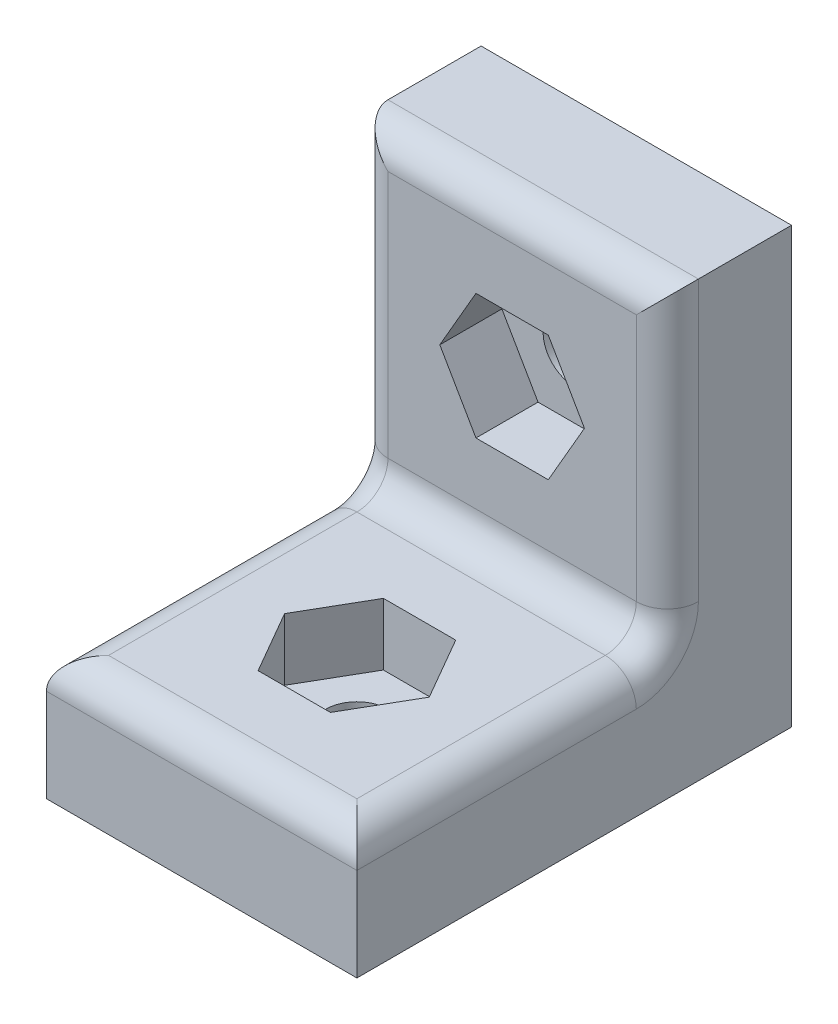
ISO-10303-21;
HEADER;
FILE_DESCRIPTION(('STEP AP214'),'2;1');
FILE_NAME('part.step','',(''),(''),'','','');
FILE_SCHEMA(('AUTOMOTIVE_DESIGN { 1 0 10303 214 1 1 1 1 }'));
ENDSEC;
DATA;
#1=APPLICATION_CONTEXT('core data for automotive mechanical design processes');
#2=APPLICATION_PROTOCOL_DEFINITION('international standard','automotive_design',2000,#1);
#3=PRODUCT_CONTEXT('',#1,'mechanical');
#4=PRODUCT('Part','Part','',(#3));
#5=PRODUCT_RELATED_PRODUCT_CATEGORY('part','',(#4));
#6=PRODUCT_DEFINITION_FORMATION('','',#4);
#7=PRODUCT_DEFINITION_CONTEXT('part definition',#1,'design');
#8=PRODUCT_DEFINITION('design','',#6,#7);
#9=PRODUCT_DEFINITION_SHAPE('','',#8);
#10=(LENGTH_UNIT() NAMED_UNIT(*) SI_UNIT(.MILLI.,.METRE.));
#11=(NAMED_UNIT(*) PLANE_ANGLE_UNIT() SI_UNIT($,.RADIAN.));
#12=(NAMED_UNIT(*) SI_UNIT($,.STERADIAN.) SOLID_ANGLE_UNIT());
#13=UNCERTAINTY_MEASURE_WITH_UNIT(LENGTH_MEASURE(1.E-05),#10,'distance_accuracy_value','');
#14=(GEOMETRIC_REPRESENTATION_CONTEXT(3) GLOBAL_UNCERTAINTY_ASSIGNED_CONTEXT((#13)) GLOBAL_UNIT_ASSIGNED_CONTEXT((#10,
#11,#12)) REPRESENTATION_CONTEXT('',''));
#15=CARTESIAN_POINT('',(0.,0.,0.));
#16=DIRECTION('',(0.,0.,1.));
#17=DIRECTION('',(1.,0.,0.));
#18=AXIS2_PLACEMENT_3D('',#15,#16,#17);
#19=CARTESIAN_POINT('',(0.,0.,9.));
#20=DIRECTION('',(0.,1.,0.));
#21=DIRECTION('',(0.,0.,1.));
#22=AXIS2_PLACEMENT_3D('',#19,#20,#21);
#23=CYLINDRICAL_SURFACE('',#22,1.);
#24=CARTESIAN_POINT('',(0.,0.,9.));
#25=DIRECTION('',(0.,1.,0.));
#26=DIRECTION('',(0.,0.,1.));
#27=AXIS2_PLACEMENT_3D('',#24,#25,#26);
#28=CIRCLE('',#27,1.);
#29=CARTESIAN_POINT('',(0.,0.,10.));
#30=VERTEX_POINT('',#29);
#31=EDGE_CURVE('E298',#30,#30,#28,.T.);
#32=ORIENTED_EDGE('',*,*,#31,.F.);
#33=EDGE_LOOP('',(#32));
#34=FACE_BOUND('',#33,.T.);
#35=CARTESIAN_POINT('',(0.,2.,9.));
#36=DIRECTION('',(0.,1.,0.));
#37=DIRECTION('',(0.,0.,1.));
#38=AXIS2_PLACEMENT_3D('',#35,#36,#37);
#39=CIRCLE('',#38,1.);
#40=CARTESIAN_POINT('',(0.,2.,10.));
#41=VERTEX_POINT('',#40);
#42=EDGE_CURVE('E43',#41,#41,#39,.F.);
#43=ORIENTED_EDGE('',*,*,#42,.F.);
#44=EDGE_LOOP('',(#43));
#45=FACE_BOUND('',#44,.T.);
#46=ADVANCED_FACE('F39',(#34,#45),#23,.F.);
#47=CARTESIAN_POINT('',(0.,9.,0.));
#48=DIRECTION('',(0.,0.,1.));
#49=DIRECTION('',(1.,0.,0.));
#50=AXIS2_PLACEMENT_3D('',#47,#48,#49);
#51=CYLINDRICAL_SURFACE('',#50,1.);
#52=CARTESIAN_POINT('',(0.,9.,0.));
#53=DIRECTION('',(0.,0.,1.));
#54=DIRECTION('',(1.,0.,0.));
#55=AXIS2_PLACEMENT_3D('',#52,#53,#54);
#56=CIRCLE('',#55,1.);
#57=CARTESIAN_POINT('',(1.,9.,0.));
#58=VERTEX_POINT('',#57);
#59=EDGE_CURVE('E302',#58,#58,#56,.T.);
#60=ORIENTED_EDGE('',*,*,#59,.F.);
#61=EDGE_LOOP('',(#60));
#62=FACE_BOUND('',#61,.T.);
#63=CARTESIAN_POINT('',(0.,9.,2.));
#64=DIRECTION('',(0.,0.,1.));
#65=DIRECTION('',(1.,0.,0.));
#66=AXIS2_PLACEMENT_3D('',#63,#64,#65);
#67=CIRCLE('',#66,1.);
#68=CARTESIAN_POINT('',(1.,9.,2.));
#69=VERTEX_POINT('',#68);
#70=EDGE_CURVE('E288',#69,#69,#67,.F.);
#71=ORIENTED_EDGE('',*,*,#70,.F.);
#72=EDGE_LOOP('',(#71));
#73=FACE_BOUND('',#72,.T.);
#74=ADVANCED_FACE('F398',(#62,#73),#51,.F.);
#75=CARTESIAN_POINT('',(-5.,14.,4.));
#76=DIRECTION('',(1.,0.,0.));
#77=DIRECTION('',(0.,1.,0.));
#78=AXIS2_PLACEMENT_3D('',#75,#76,#77);
#79=PLANE('',#78);
#80=CARTESIAN_POINT('',(-5.,5.,5.));
#81=DIRECTION('',(1.,0.,0.));
#82=DIRECTION('',(0.,1.,0.));
#83=AXIS2_PLACEMENT_3D('',#80,#81,#82);
#84=CIRCLE('',#83,2.);
#85=CARTESIAN_POINT('',(-5.,5.,3.));
#86=VERTEX_POINT('',#85);
#87=CARTESIAN_POINT('',(-5.,3.,5.));
#88=VERTEX_POINT('',#87);
#89=EDGE_CURVE('E352',#86,#88,#84,.F.);
#90=ORIENTED_EDGE('',*,*,#89,.F.);
#91=DIRECTION('',(0.,-1.,0.));
#92=VECTOR('',#91,1.);
#93=CARTESIAN_POINT('',(-5.,14.,3.));
#94=LINE('',#93,#92);
#95=CARTESIAN_POINT('',(-5.,14.,3.));
#96=VERTEX_POINT('',#95);
#97=EDGE_CURVE('E357',#86,#96,#94,.F.);
#98=ORIENTED_EDGE('',*,*,#97,.T.);
#99=DIRECTION('',(0.,0.,-1.));
#100=VECTOR('',#99,1.);
#101=CARTESIAN_POINT('',(-5.,14.,4.));
#102=LINE('',#101,#100);
#103=CARTESIAN_POINT('',(-5.,14.,0.));
#104=VERTEX_POINT('',#103);
#105=EDGE_CURVE('E325',#96,#104,#102,.T.);
#106=ORIENTED_EDGE('',*,*,#105,.T.);
#107=DIRECTION('',(0.,-1.,0.));
#108=VECTOR('',#107,1.);
#109=CARTESIAN_POINT('',(-5.,14.,0.));
#110=LINE('',#109,#108);
#111=CARTESIAN_POINT('',(-5.,0.,0.));
#112=VERTEX_POINT('',#111);
#113=EDGE_CURVE('E314',#104,#112,#110,.T.);
#114=ORIENTED_EDGE('',*,*,#113,.T.);
#115=DIRECTION('',(0.,0.,-1.));
#116=VECTOR('',#115,1.);
#117=CARTESIAN_POINT('',(-5.,0.,4.));
#118=LINE('',#117,#116);
#119=CARTESIAN_POINT('',(-5.,0.,14.));
#120=VERTEX_POINT('',#119);
#121=EDGE_CURVE('E332',#120,#112,#118,.T.);
#122=ORIENTED_EDGE('',*,*,#121,.F.);
#123=DIRECTION('',(0.,-1.,0.));
#124=VECTOR('',#123,1.);
#125=CARTESIAN_POINT('',(-5.,0.,14.));
#126=LINE('',#125,#124);
#127=CARTESIAN_POINT('',(-5.,3.,14.));
#128=VERTEX_POINT('',#127);
#129=EDGE_CURVE('E305',#128,#120,#126,.T.);
#130=ORIENTED_EDGE('',*,*,#129,.F.);
#131=DIRECTION('',(0.,0.,-1.));
#132=VECTOR('',#131,1.);
#133=CARTESIAN_POINT('',(-5.,3.,4.));
#134=LINE('',#133,#132);
#135=EDGE_CURVE('E355',#128,#88,#134,.T.);
#136=ORIENTED_EDGE('',*,*,#135,.T.);
#137=EDGE_LOOP('',(#90,#98,#106,#114,#122,#130,#136));
#138=FACE_BOUND('',#137,.T.);
#139=ADVANCED_FACE('F400',(#138),#79,.F.);
#140=CARTESIAN_POINT('',(-5.,0.,4.));
#141=DIRECTION('',(0.,1.,0.));
#142=DIRECTION('',(0.,0.,1.));
#143=AXIS2_PLACEMENT_3D('',#140,#141,#142);
#144=PLANE('',#143);
#145=ORIENTED_EDGE('',*,*,#31,.T.);
#146=EDGE_LOOP('',(#145));
#147=FACE_BOUND('',#146,.T.);
#148=DIRECTION('',(1.,0.,0.));
#149=VECTOR('',#148,1.);
#150=CARTESIAN_POINT('',(-5.,0.,0.));
#151=LINE('',#150,#149);
#152=CARTESIAN_POINT('',(5.,0.,0.));
#153=VERTEX_POINT('',#152);
#154=EDGE_CURVE('E317',#112,#153,#151,.T.);
#155=ORIENTED_EDGE('',*,*,#154,.T.);
#156=DIRECTION('',(0.,0.,-1.));
#157=VECTOR('',#156,1.);
#158=CARTESIAN_POINT('',(5.,0.,4.));
#159=LINE('',#158,#157);
#160=CARTESIAN_POINT('',(5.,0.,14.));
#161=VERTEX_POINT('',#160);
#162=EDGE_CURVE('E329',#161,#153,#159,.T.);
#163=ORIENTED_EDGE('',*,*,#162,.F.);
#164=DIRECTION('',(1.,0.,0.));
#165=VECTOR('',#164,1.);
#166=CARTESIAN_POINT('',(-5.,0.,14.));
#167=LINE('',#166,#165);
#168=EDGE_CURVE('E308',#120,#161,#167,.T.);
#169=ORIENTED_EDGE('',*,*,#168,.F.);
#170=ORIENTED_EDGE('',*,*,#121,.T.);
#171=EDGE_LOOP('',(#155,#163,#169,#170));
#172=FACE_BOUND('',#171,.T.);
#173=ADVANCED_FACE('F407',(#147,#172),#144,.F.);
#174=CARTESIAN_POINT('',(5.,14.,4.));
#175=DIRECTION('',(-1.,0.,0.));
#176=DIRECTION('',(0.,-1.,0.));
#177=AXIS2_PLACEMENT_3D('',#174,#175,#176);
#178=PLANE('',#177);
#179=DIRECTION('',(0.,0.,-1.));
#180=VECTOR('',#179,1.);
#181=CARTESIAN_POINT('',(5.,14.,4.));
#182=LINE('',#181,#180);
#183=CARTESIAN_POINT('',(5.,14.,3.));
#184=VERTEX_POINT('',#183);
#185=CARTESIAN_POINT('',(5.,14.,0.));
#186=VERTEX_POINT('',#185);
#187=EDGE_CURVE('E327',#184,#186,#182,.T.);
#188=ORIENTED_EDGE('',*,*,#187,.F.);
#189=DIRECTION('',(0.,1.,0.));
#190=VECTOR('',#189,1.);
#191=CARTESIAN_POINT('',(5.,4.,3.));
#192=LINE('',#191,#190);
#193=CARTESIAN_POINT('',(5.,5.,3.));
#194=VERTEX_POINT('',#193);
#195=EDGE_CURVE('E349',#184,#194,#192,.F.);
#196=ORIENTED_EDGE('',*,*,#195,.T.);
#197=CARTESIAN_POINT('',(5.,5.,5.));
#198=DIRECTION('',(-1.,0.,0.));
#199=DIRECTION('',(0.,-1.,0.));
#200=AXIS2_PLACEMENT_3D('',#197,#198,#199);
#201=CIRCLE('',#200,2.);
#202=CARTESIAN_POINT('',(5.,3.,5.));
#203=VERTEX_POINT('',#202);
#204=EDGE_CURVE('E346',#203,#194,#201,.F.);
#205=ORIENTED_EDGE('',*,*,#204,.F.);
#206=DIRECTION('',(0.,0.,-1.));
#207=VECTOR('',#206,1.);
#208=CARTESIAN_POINT('',(5.,3.,4.));
#209=LINE('',#208,#207);
#210=CARTESIAN_POINT('',(5.,3.,14.));
#211=VERTEX_POINT('',#210);
#212=EDGE_CURVE('E344',#203,#211,#209,.F.);
#213=ORIENTED_EDGE('',*,*,#212,.T.);
#214=DIRECTION('',(0.,1.,0.));
#215=VECTOR('',#214,1.);
#216=CARTESIAN_POINT('',(5.,0.,14.));
#217=LINE('',#216,#215);
#218=EDGE_CURVE('E311',#161,#211,#217,.T.);
#219=ORIENTED_EDGE('',*,*,#218,.F.);
#220=ORIENTED_EDGE('',*,*,#162,.T.);
#221=DIRECTION('',(0.,1.,0.));
#222=VECTOR('',#221,1.);
#223=CARTESIAN_POINT('',(5.,14.,0.));
#224=LINE('',#223,#222);
#225=EDGE_CURVE('E319',#153,#186,#224,.T.);
#226=ORIENTED_EDGE('',*,*,#225,.T.);
#227=EDGE_LOOP('',(#188,#196,#205,#213,#219,#220,#226));
#228=FACE_BOUND('',#227,.T.);
#229=ADVANCED_FACE('F434',(#228),#178,.F.);
#230=CARTESIAN_POINT('',(-5.,14.,4.));
#231=DIRECTION('',(0.,-1.,0.));
#232=DIRECTION('',(0.,0.,-1.));
#233=AXIS2_PLACEMENT_3D('',#230,#231,#232);
#234=PLANE('',#233);
#235=ORIENTED_EDGE('',*,*,#105,.F.);
#236=DIRECTION('',(-1.,0.,0.));
#237=VECTOR('',#236,1.);
#238=CARTESIAN_POINT('',(5.,14.,3.));
#239=LINE('',#238,#237);
#240=EDGE_CURVE('E359',#96,#184,#239,.F.);
#241=ORIENTED_EDGE('',*,*,#240,.T.);
#242=ORIENTED_EDGE('',*,*,#187,.T.);
#243=DIRECTION('',(-1.,0.,0.));
#244=VECTOR('',#243,1.);
#245=CARTESIAN_POINT('',(-5.,14.,0.));
#246=LINE('',#245,#244);
#247=EDGE_CURVE('E322',#186,#104,#246,.T.);
#248=ORIENTED_EDGE('',*,*,#247,.T.);
#249=EDGE_LOOP('',(#235,#241,#242,#248));
#250=FACE_BOUND('',#249,.T.);
#251=ADVANCED_FACE('F427',(#250),#234,.F.);
#252=CARTESIAN_POINT('',(0.,0.,4.));
#253=DIRECTION('',(0.,0.,1.));
#254=DIRECTION('',(1.,0.,0.));
#255=AXIS2_PLACEMENT_3D('',#252,#253,#254);
#256=PLANE('',#255);
#257=DIRECTION('',(1.,0.,0.));
#258=VECTOR('',#257,1.);
#259=CARTESIAN_POINT('',(-1.165,6.98216080918226,4.));
#260=LINE('',#259,#258);
#261=CARTESIAN_POINT('',(-1.165,6.98216080918226,4.));
#262=VERTEX_POINT('',#261);
#263=CARTESIAN_POINT('',(1.165,6.98216080918226,4.));
#264=VERTEX_POINT('',#263);
#265=EDGE_CURVE('E64',#262,#264,#260,.T.);
#266=ORIENTED_EDGE('',*,*,#265,.F.);
#267=DIRECTION('',(0.5,-0.866025403784439,0.));
#268=VECTOR('',#267,1.);
#269=CARTESIAN_POINT('',(-2.33,9.,4.));
#270=LINE('',#269,#268);
#271=CARTESIAN_POINT('',(-2.33,9.,4.));
#272=VERTEX_POINT('',#271);
#273=EDGE_CURVE('E255',#272,#262,#270,.T.);
#274=ORIENTED_EDGE('',*,*,#273,.F.);
#275=DIRECTION('',(-0.5,-0.866025403784439,0.));
#276=VECTOR('',#275,1.);
#277=CARTESIAN_POINT('',(-1.165,11.0178391908177,4.));
#278=LINE('',#277,#276);
#279=CARTESIAN_POINT('',(-1.165,11.0178391908177,4.));
#280=VERTEX_POINT('',#279);
#281=EDGE_CURVE('E281',#280,#272,#278,.T.);
#282=ORIENTED_EDGE('',*,*,#281,.F.);
#283=DIRECTION('',(-1.,0.,0.));
#284=VECTOR('',#283,1.);
#285=CARTESIAN_POINT('',(1.165,11.0178391908177,4.));
#286=LINE('',#285,#284);
#287=CARTESIAN_POINT('',(1.165,11.0178391908177,4.));
#288=VERTEX_POINT('',#287);
#289=EDGE_CURVE('E278',#288,#280,#286,.T.);
#290=ORIENTED_EDGE('',*,*,#289,.F.);
#291=DIRECTION('',(-0.5,0.866025403784439,0.));
#292=VECTOR('',#291,1.);
#293=CARTESIAN_POINT('',(2.33,9.,4.));
#294=LINE('',#293,#292);
#295=CARTESIAN_POINT('',(2.33,9.,4.));
#296=VERTEX_POINT('',#295);
#297=EDGE_CURVE('E275',#296,#288,#294,.T.);
#298=ORIENTED_EDGE('',*,*,#297,.F.);
#299=DIRECTION('',(0.5,0.866025403784439,0.));
#300=VECTOR('',#299,1.);
#301=CARTESIAN_POINT('',(1.165,6.98216080918226,4.));
#302=LINE('',#301,#300);
#303=EDGE_CURVE('E272',#264,#296,#302,.T.);
#304=ORIENTED_EDGE('',*,*,#303,.F.);
#305=EDGE_LOOP('',(#266,#274,#282,#290,#298,#304));
#306=FACE_BOUND('',#305,.T.);
#307=DIRECTION('',(0.,1.,0.));
#308=VECTOR('',#307,1.);
#309=CARTESIAN_POINT('',(4.,14.,4.));
#310=LINE('',#309,#308);
#311=CARTESIAN_POINT('',(4.,5.,4.));
#312=VERTEX_POINT('',#311);
#313=CARTESIAN_POINT('',(4.,13.,4.));
#314=VERTEX_POINT('',#313);
#315=EDGE_CURVE('E339',#312,#314,#310,.T.);
#316=ORIENTED_EDGE('',*,*,#315,.T.);
#317=DIRECTION('',(-1.,0.,0.));
#318=VECTOR('',#317,1.);
#319=CARTESIAN_POINT('',(-5.,13.,4.));
#320=LINE('',#319,#318);
#321=CARTESIAN_POINT('',(-4.,13.,4.));
#322=VERTEX_POINT('',#321);
#323=EDGE_CURVE('E342',#314,#322,#320,.T.);
#324=ORIENTED_EDGE('',*,*,#323,.T.);
#325=DIRECTION('',(0.,-1.,0.));
#326=VECTOR('',#325,1.);
#327=CARTESIAN_POINT('',(-4.,4.,4.));
#328=LINE('',#327,#326);
#329=CARTESIAN_POINT('',(-4.,5.,4.));
#330=VERTEX_POINT('',#329);
#331=EDGE_CURVE('E337',#322,#330,#328,.T.);
#332=ORIENTED_EDGE('',*,*,#331,.T.);
#333=DIRECTION('',(-1.,0.,0.));
#334=VECTOR('',#333,1.);
#335=CARTESIAN_POINT('',(0.,5.,4.));
#336=LINE('',#335,#334);
#337=EDGE_CURVE('E335',#330,#312,#336,.F.);
#338=ORIENTED_EDGE('',*,*,#337,.T.);
#339=EDGE_LOOP('',(#316,#324,#332,#338));
#340=FACE_BOUND('',#339,.T.);
#341=ADVANCED_FACE('F424',(#306,#340),#256,.T.);
#342=CARTESIAN_POINT('',(0.,0.,0.));
#343=DIRECTION('',(0.,0.,1.));
#344=DIRECTION('',(1.,0.,0.));
#345=AXIS2_PLACEMENT_3D('',#342,#343,#344);
#346=PLANE('',#345);
#347=ORIENTED_EDGE('',*,*,#59,.T.);
#348=EDGE_LOOP('',(#347));
#349=FACE_BOUND('',#348,.T.);
#350=ORIENTED_EDGE('',*,*,#113,.F.);
#351=ORIENTED_EDGE('',*,*,#247,.F.);
#352=ORIENTED_EDGE('',*,*,#225,.F.);
#353=ORIENTED_EDGE('',*,*,#154,.F.);
#354=EDGE_LOOP('',(#350,#351,#352,#353));
#355=FACE_BOUND('',#354,.T.);
#356=ADVANCED_FACE('F422',(#349,#355),#346,.F.);
#357=CARTESIAN_POINT('',(-5.,4.,14.));
#358=DIRECTION('',(0.,-1.,0.));
#359=DIRECTION('',(0.,0.,-1.));
#360=AXIS2_PLACEMENT_3D('',#357,#358,#359);
#361=PLANE('',#360);
#362=DIRECTION('',(-0.5,0.,-0.866025403784439));
#363=VECTOR('',#362,1.);
#364=CARTESIAN_POINT('',(2.33,4.,9.));
#365=LINE('',#364,#363);
#366=CARTESIAN_POINT('',(2.33,4.,9.));
#367=VERTEX_POINT('',#366);
#368=CARTESIAN_POINT('',(1.165,4.,6.98216080918226));
#369=VERTEX_POINT('',#368);
#370=EDGE_CURVE('E232',#367,#369,#365,.T.);
#371=ORIENTED_EDGE('',*,*,#370,.F.);
#372=DIRECTION('',(0.5,0.,-0.866025403784439));
#373=VECTOR('',#372,1.);
#374=CARTESIAN_POINT('',(1.165,4.,11.0178391908177));
#375=LINE('',#374,#373);
#376=CARTESIAN_POINT('',(1.165,4.,11.0178391908177));
#377=VERTEX_POINT('',#376);
#378=EDGE_CURVE('E56',#377,#367,#375,.T.);
#379=ORIENTED_EDGE('',*,*,#378,.F.);
#380=DIRECTION('',(1.,0.,0.));
#381=VECTOR('',#380,1.);
#382=CARTESIAN_POINT('',(-1.165,4.,11.0178391908177));
#383=LINE('',#382,#381);
#384=CARTESIAN_POINT('',(-1.165,4.,11.0178391908177));
#385=VERTEX_POINT('',#384);
#386=EDGE_CURVE('E218',#385,#377,#383,.T.);
#387=ORIENTED_EDGE('',*,*,#386,.F.);
#388=DIRECTION('',(0.5,0.,0.866025403784439));
#389=VECTOR('',#388,1.);
#390=CARTESIAN_POINT('',(-2.33,4.,9.));
#391=LINE('',#390,#389);
#392=CARTESIAN_POINT('',(-2.33,4.,9.));
#393=VERTEX_POINT('',#392);
#394=EDGE_CURVE('E221',#393,#385,#391,.T.);
#395=ORIENTED_EDGE('',*,*,#394,.F.);
#396=DIRECTION('',(-0.5,0.,0.866025403784439));
#397=VECTOR('',#396,1.);
#398=CARTESIAN_POINT('',(-1.165,4.,6.98216080918226));
#399=LINE('',#398,#397);
#400=CARTESIAN_POINT('',(-1.165,4.,6.98216080918226));
#401=VERTEX_POINT('',#400);
#402=EDGE_CURVE('E237',#401,#393,#399,.T.);
#403=ORIENTED_EDGE('',*,*,#402,.F.);
#404=DIRECTION('',(-1.,0.,0.));
#405=VECTOR('',#404,1.);
#406=CARTESIAN_POINT('',(1.165,4.,6.98216080918226));
#407=LINE('',#406,#405);
#408=EDGE_CURVE('E234',#369,#401,#407,.T.);
#409=ORIENTED_EDGE('',*,*,#408,.F.);
#410=EDGE_LOOP('',(#371,#379,#387,#395,#403,#409));
#411=FACE_BOUND('',#410,.T.);
#412=DIRECTION('',(0.,0.,-1.));
#413=VECTOR('',#412,1.);
#414=CARTESIAN_POINT('',(-4.,4.,14.));
#415=LINE('',#414,#413);
#416=CARTESIAN_POINT('',(-4.,4.,5.));
#417=VERTEX_POINT('',#416);
#418=CARTESIAN_POINT('',(-4.,4.,13.));
#419=VERTEX_POINT('',#418);
#420=EDGE_CURVE('E365',#417,#419,#415,.F.);
#421=ORIENTED_EDGE('',*,*,#420,.T.);
#422=DIRECTION('',(-1.,0.,0.));
#423=VECTOR('',#422,1.);
#424=CARTESIAN_POINT('',(-5.,4.,13.));
#425=LINE('',#424,#423);
#426=CARTESIAN_POINT('',(4.,4.,13.));
#427=VERTEX_POINT('',#426);
#428=EDGE_CURVE('E12',#419,#427,#425,.F.);
#429=ORIENTED_EDGE('',*,*,#428,.T.);
#430=DIRECTION('',(0.,0.,-1.));
#431=VECTOR('',#430,1.);
#432=CARTESIAN_POINT('',(4.,4.,14.));
#433=LINE('',#432,#431);
#434=CARTESIAN_POINT('',(4.,4.,5.));
#435=VERTEX_POINT('',#434);
#436=EDGE_CURVE('E48',#427,#435,#433,.T.);
#437=ORIENTED_EDGE('',*,*,#436,.T.);
#438=DIRECTION('',(-1.,0.,0.));
#439=VECTOR('',#438,1.);
#440=CARTESIAN_POINT('',(-5.,4.,5.));
#441=LINE('',#440,#439);
#442=EDGE_CURVE('E363',#435,#417,#441,.T.);
#443=ORIENTED_EDGE('',*,*,#442,.T.);
#444=EDGE_LOOP('',(#421,#429,#437,#443));
#445=FACE_BOUND('',#444,.T.);
#446=ADVANCED_FACE('F418',(#411,#445),#361,.F.);
#447=CARTESIAN_POINT('',(0.,0.,14.));
#448=DIRECTION('',(0.,0.,-1.));
#449=DIRECTION('',(-1.,0.,0.));
#450=AXIS2_PLACEMENT_3D('',#447,#448,#449);
#451=PLANE('',#450);
#452=ORIENTED_EDGE('',*,*,#218,.T.);
#453=DIRECTION('',(-1.,0.,0.));
#454=VECTOR('',#453,1.);
#455=CARTESIAN_POINT('',(0.,3.,14.));
#456=LINE('',#455,#454);
#457=EDGE_CURVE('E361',#211,#128,#456,.T.);
#458=ORIENTED_EDGE('',*,*,#457,.T.);
#459=ORIENTED_EDGE('',*,*,#129,.T.);
#460=ORIENTED_EDGE('',*,*,#168,.T.);
#461=EDGE_LOOP('',(#452,#458,#459,#460));
#462=FACE_BOUND('',#461,.T.);
#463=ADVANCED_FACE('F415',(#462),#451,.F.);
#464=CARTESIAN_POINT('',(-4.,3.,4.));
#465=DIRECTION('',(0.,0.,-1.));
#466=DIRECTION('',(-1.,0.,0.));
#467=AXIS2_PLACEMENT_3D('',#464,#465,#466);
#468=CYLINDRICAL_SURFACE('',#467,1.);
#469=CARTESIAN_POINT('',(-4.,3.,5.));
#470=DIRECTION('',(0.,0.,-1.));
#471=DIRECTION('',(-1.,0.,0.));
#472=AXIS2_PLACEMENT_3D('',#469,#470,#471);
#473=CIRCLE('',#472,1.);
#474=EDGE_CURVE('E389',#88,#417,#473,.T.);
#475=ORIENTED_EDGE('',*,*,#474,.F.);
#476=ORIENTED_EDGE('',*,*,#135,.F.);
#477=CARTESIAN_POINT('',(-4.,3.,13.));
#478=DIRECTION('',(-0.707106781186547,0.,-0.707106781186547));
#479=DIRECTION('',(0.707106781186547,0.,-0.707106781186547));
#480=AXIS2_PLACEMENT_3D('',#477,#478,#479);
#481=ELLIPSE('',#480,1.41421356237309,1.);
#482=EDGE_CURVE('E306',#419,#128,#481,.F.);
#483=ORIENTED_EDGE('',*,*,#482,.F.);
#484=ORIENTED_EDGE('',*,*,#420,.F.);
#485=EDGE_LOOP('',(#475,#476,#483,#484));
#486=FACE_BOUND('',#485,.T.);
#487=ADVANCED_FACE('F41',(#486),#468,.T.);
#488=CARTESIAN_POINT('',(0.,3.,13.));
#489=DIRECTION('',(-1.,0.,0.));
#490=DIRECTION('',(0.,0.,1.));
#491=AXIS2_PLACEMENT_3D('',#488,#489,#490);
#492=CYLINDRICAL_SURFACE('',#491,1.);
#493=ORIENTED_EDGE('',*,*,#482,.T.);
#494=ORIENTED_EDGE('',*,*,#457,.F.);
#495=CARTESIAN_POINT('',(4.,3.,13.));
#496=DIRECTION('',(0.707106781186547,0.,-0.707106781186547));
#497=DIRECTION('',(-0.707106781186547,0.,-0.707106781186547));
#498=AXIS2_PLACEMENT_3D('',#495,#496,#497);
#499=ELLIPSE('',#498,1.41421356237309,1.);
#500=EDGE_CURVE('E386',#427,#211,#499,.T.);
#501=ORIENTED_EDGE('',*,*,#500,.F.);
#502=ORIENTED_EDGE('',*,*,#428,.F.);
#503=EDGE_LOOP('',(#493,#494,#501,#502));
#504=FACE_BOUND('',#503,.T.);
#505=ADVANCED_FACE('F468',(#504),#492,.T.);
#506=CARTESIAN_POINT('',(-4.,5.,5.));
#507=DIRECTION('',(1.,0.,0.));
#508=DIRECTION('',(0.,1.,0.));
#509=AXIS2_PLACEMENT_3D('',#506,#507,#508);
#510=TOROIDAL_SURFACE('',#509,2.,1.);
#511=ORIENTED_EDGE('',*,*,#89,.T.);
#512=ORIENTED_EDGE('',*,*,#474,.T.);
#513=CARTESIAN_POINT('',(-4.,5.,5.));
#514=DIRECTION('',(1.,0.,0.));
#515=DIRECTION('',(0.,1.,0.));
#516=AXIS2_PLACEMENT_3D('',#513,#514,#515);
#517=CIRCLE('',#516,1.);
#518=EDGE_CURVE('E383',#330,#417,#517,.F.);
#519=ORIENTED_EDGE('',*,*,#518,.F.);
#520=CARTESIAN_POINT('',(-4.,5.,3.));
#521=DIRECTION('',(0.,-1.,0.));
#522=DIRECTION('',(0.,0.,-1.));
#523=AXIS2_PLACEMENT_3D('',#520,#521,#522);
#524=CIRCLE('',#523,1.);
#525=EDGE_CURVE('E380',#86,#330,#524,.F.);
#526=ORIENTED_EDGE('',*,*,#525,.F.);
#527=EDGE_LOOP('',(#511,#512,#519,#526));
#528=FACE_BOUND('',#527,.T.);
#529=ADVANCED_FACE('F465',(#528),#510,.T.);
#530=CARTESIAN_POINT('',(4.,3.,14.));
#531=DIRECTION('',(0.,0.,-1.));
#532=DIRECTION('',(-1.,0.,0.));
#533=AXIS2_PLACEMENT_3D('',#530,#531,#532);
#534=CYLINDRICAL_SURFACE('',#533,1.);
#535=ORIENTED_EDGE('',*,*,#500,.T.);
#536=ORIENTED_EDGE('',*,*,#212,.F.);
#537=CARTESIAN_POINT('',(4.,3.,5.));
#538=DIRECTION('',(0.,0.,-1.));
#539=DIRECTION('',(-1.,0.,0.));
#540=AXIS2_PLACEMENT_3D('',#537,#538,#539);
#541=CIRCLE('',#540,1.);
#542=EDGE_CURVE('E377',#435,#203,#541,.T.);
#543=ORIENTED_EDGE('',*,*,#542,.F.);
#544=ORIENTED_EDGE('',*,*,#436,.F.);
#545=EDGE_LOOP('',(#535,#536,#543,#544));
#546=FACE_BOUND('',#545,.T.);
#547=ADVANCED_FACE('F461',(#546),#534,.T.);
#548=CARTESIAN_POINT('',(-5.,5.,5.));
#549=DIRECTION('',(-1.,0.,0.));
#550=DIRECTION('',(0.,0.,1.));
#551=AXIS2_PLACEMENT_3D('',#548,#549,#550);
#552=CYLINDRICAL_SURFACE('',#551,1.);
#553=ORIENTED_EDGE('',*,*,#518,.T.);
#554=ORIENTED_EDGE('',*,*,#442,.F.);
#555=CARTESIAN_POINT('',(4.,5.,5.));
#556=DIRECTION('',(-1.,0.,0.));
#557=DIRECTION('',(0.,-1.,0.));
#558=AXIS2_PLACEMENT_3D('',#555,#556,#557);
#559=CIRCLE('',#558,1.);
#560=EDGE_CURVE('E374',#312,#435,#559,.T.);
#561=ORIENTED_EDGE('',*,*,#560,.F.);
#562=ORIENTED_EDGE('',*,*,#337,.F.);
#563=EDGE_LOOP('',(#553,#554,#561,#562));
#564=FACE_BOUND('',#563,.T.);
#565=ADVANCED_FACE('F457',(#564),#552,.F.);
#566=CARTESIAN_POINT('',(-4.,0.,3.));
#567=DIRECTION('',(0.,1.,0.));
#568=DIRECTION('',(-1.,0.,0.));
#569=AXIS2_PLACEMENT_3D('',#566,#567,#568);
#570=CYLINDRICAL_SURFACE('',#569,1.);
#571=ORIENTED_EDGE('',*,*,#525,.T.);
#572=ORIENTED_EDGE('',*,*,#331,.F.);
#573=CARTESIAN_POINT('',(-4.,13.,3.));
#574=DIRECTION('',(0.707106781186547,0.707106781186548,0.));
#575=DIRECTION('',(0.707106781186548,-0.707106781186547,0.));
#576=AXIS2_PLACEMENT_3D('',#573,#574,#575);
#577=ELLIPSE('',#576,1.4142135623731,1.);
#578=EDGE_CURVE('E371',#96,#322,#577,.T.);
#579=ORIENTED_EDGE('',*,*,#578,.F.);
#580=ORIENTED_EDGE('',*,*,#97,.F.);
#581=EDGE_LOOP('',(#571,#572,#579,#580));
#582=FACE_BOUND('',#581,.T.);
#583=ADVANCED_FACE('F453',(#582),#570,.T.);
#584=CARTESIAN_POINT('',(4.,5.,5.));
#585=DIRECTION('',(-1.,0.,0.));
#586=DIRECTION('',(0.,-1.,0.));
#587=AXIS2_PLACEMENT_3D('',#584,#585,#586);
#588=TOROIDAL_SURFACE('',#587,2.,1.);
#589=ORIENTED_EDGE('',*,*,#542,.T.);
#590=ORIENTED_EDGE('',*,*,#204,.T.);
#591=CARTESIAN_POINT('',(4.,5.,3.));
#592=DIRECTION('',(0.,-1.,0.));
#593=DIRECTION('',(0.,0.,-1.));
#594=AXIS2_PLACEMENT_3D('',#591,#592,#593);
#595=CIRCLE('',#594,1.);
#596=EDGE_CURVE('E369',#312,#194,#595,.F.);
#597=ORIENTED_EDGE('',*,*,#596,.F.);
#598=ORIENTED_EDGE('',*,*,#560,.T.);
#599=EDGE_LOOP('',(#589,#590,#597,#598));
#600=FACE_BOUND('',#599,.T.);
#601=ADVANCED_FACE('F449',(#600),#588,.T.);
#602=CARTESIAN_POINT('',(0.,13.,3.));
#603=DIRECTION('',(1.,0.,0.));
#604=DIRECTION('',(0.,0.,-1.));
#605=AXIS2_PLACEMENT_3D('',#602,#603,#604);
#606=CYLINDRICAL_SURFACE('',#605,1.);
#607=ORIENTED_EDGE('',*,*,#578,.T.);
#608=ORIENTED_EDGE('',*,*,#323,.F.);
#609=CARTESIAN_POINT('',(4.,13.,3.));
#610=DIRECTION('',(0.707106781186548,-0.707106781186547,0.));
#611=DIRECTION('',(0.707106781186547,0.707106781186548,0.));
#612=AXIS2_PLACEMENT_3D('',#609,#610,#611);
#613=ELLIPSE('',#612,1.41421356237309,1.);
#614=EDGE_CURVE('E301',#184,#314,#613,.T.);
#615=ORIENTED_EDGE('',*,*,#614,.F.);
#616=ORIENTED_EDGE('',*,*,#240,.F.);
#617=EDGE_LOOP('',(#607,#608,#615,#616));
#618=FACE_BOUND('',#617,.T.);
#619=ADVANCED_FACE('F445',(#618),#606,.T.);
#620=CARTESIAN_POINT('',(4.,0.,3.));
#621=DIRECTION('',(0.,-1.,0.));
#622=DIRECTION('',(1.,0.,0.));
#623=AXIS2_PLACEMENT_3D('',#620,#621,#622);
#624=CYLINDRICAL_SURFACE('',#623,1.);
#625=ORIENTED_EDGE('',*,*,#596,.T.);
#626=ORIENTED_EDGE('',*,*,#195,.F.);
#627=ORIENTED_EDGE('',*,*,#614,.T.);
#628=ORIENTED_EDGE('',*,*,#315,.F.);
#629=EDGE_LOOP('',(#625,#626,#627,#628));
#630=FACE_BOUND('',#629,.T.);
#631=ADVANCED_FACE('F442',(#630),#624,.T.);
#632=CARTESIAN_POINT('',(0.,0.,2.));
#633=DIRECTION('',(0.,0.,1.));
#634=DIRECTION('',(1.,0.,0.));
#635=AXIS2_PLACEMENT_3D('',#632,#633,#634);
#636=PLANE('',#635);
#637=DIRECTION('',(1.,0.,0.));
#638=VECTOR('',#637,1.);
#639=CARTESIAN_POINT('',(-1.165,6.98216080918226,2.));
#640=LINE('',#639,#638);
#641=CARTESIAN_POINT('',(-1.165,6.98216080918226,2.));
#642=VERTEX_POINT('',#641);
#643=CARTESIAN_POINT('',(1.165,6.98216080918226,2.));
#644=VERTEX_POINT('',#643);
#645=EDGE_CURVE('E251',#642,#644,#640,.T.);
#646=ORIENTED_EDGE('',*,*,#645,.T.);
#647=DIRECTION('',(0.5,0.866025403784439,0.));
#648=VECTOR('',#647,1.);
#649=CARTESIAN_POINT('',(1.165,6.98216080918226,2.));
#650=LINE('',#649,#648);
#651=CARTESIAN_POINT('',(2.33,9.,2.));
#652=VERTEX_POINT('',#651);
#653=EDGE_CURVE('E254',#644,#652,#650,.T.);
#654=ORIENTED_EDGE('',*,*,#653,.T.);
#655=DIRECTION('',(-0.5,0.866025403784439,0.));
#656=VECTOR('',#655,1.);
#657=CARTESIAN_POINT('',(2.33,9.,2.));
#658=LINE('',#657,#656);
#659=CARTESIAN_POINT('',(1.165,11.0178391908177,2.));
#660=VERTEX_POINT('',#659);
#661=EDGE_CURVE('E258',#652,#660,#658,.T.);
#662=ORIENTED_EDGE('',*,*,#661,.T.);
#663=DIRECTION('',(-1.,0.,0.));
#664=VECTOR('',#663,1.);
#665=CARTESIAN_POINT('',(1.165,11.0178391908177,2.));
#666=LINE('',#665,#664);
#667=CARTESIAN_POINT('',(-1.165,11.0178391908177,2.));
#668=VERTEX_POINT('',#667);
#669=EDGE_CURVE('E261',#660,#668,#666,.T.);
#670=ORIENTED_EDGE('',*,*,#669,.T.);
#671=DIRECTION('',(-0.5,-0.866025403784439,0.));
#672=VECTOR('',#671,1.);
#673=CARTESIAN_POINT('',(-1.165,11.0178391908177,2.));
#674=LINE('',#673,#672);
#675=CARTESIAN_POINT('',(-2.33,9.,2.));
#676=VERTEX_POINT('',#675);
#677=EDGE_CURVE('E264',#668,#676,#674,.T.);
#678=ORIENTED_EDGE('',*,*,#677,.T.);
#679=DIRECTION('',(0.5,-0.866025403784439,0.));
#680=VECTOR('',#679,1.);
#681=CARTESIAN_POINT('',(-2.33,9.,2.));
#682=LINE('',#681,#680);
#683=EDGE_CURVE('E267',#676,#642,#682,.T.);
#684=ORIENTED_EDGE('',*,*,#683,.T.);
#685=EDGE_LOOP('',(#646,#654,#662,#670,#678,#684));
#686=FACE_BOUND('',#685,.T.);
#687=ORIENTED_EDGE('',*,*,#70,.T.);
#688=EDGE_LOOP('',(#687));
#689=FACE_BOUND('',#688,.T.);
#690=ADVANCED_FACE('F396',(#686,#689),#636,.T.);
#691=CARTESIAN_POINT('',(-1.165,6.98216080918226,2.));
#692=DIRECTION('',(0.,-1.,0.));
#693=DIRECTION('',(0.,0.,-1.));
#694=AXIS2_PLACEMENT_3D('',#691,#692,#693);
#695=PLANE('',#694);
#696=ORIENTED_EDGE('',*,*,#265,.T.);
#697=DIRECTION('',(0.,0.,1.));
#698=VECTOR('',#697,1.);
#699=CARTESIAN_POINT('',(1.165,6.98216080918226,2.));
#700=LINE('',#699,#698);
#701=EDGE_CURVE('E270',#644,#264,#700,.T.);
#702=ORIENTED_EDGE('',*,*,#701,.F.);
#703=ORIENTED_EDGE('',*,*,#645,.F.);
#704=DIRECTION('',(0.,0.,1.));
#705=VECTOR('',#704,1.);
#706=CARTESIAN_POINT('',(-1.165,6.98216080918226,2.));
#707=LINE('',#706,#705);
#708=EDGE_CURVE('E286',#642,#262,#707,.T.);
#709=ORIENTED_EDGE('',*,*,#708,.T.);
#710=EDGE_LOOP('',(#696,#702,#703,#709));
#711=FACE_BOUND('',#710,.T.);
#712=ADVANCED_FACE('F626',(#711),#695,.F.);
#713=CARTESIAN_POINT('',(-2.33,9.,2.));
#714=DIRECTION('',(-0.866025403784439,-0.5,0.));
#715=DIRECTION('',(0.5,-0.866025403784439,0.));
#716=AXIS2_PLACEMENT_3D('',#713,#714,#715);
#717=PLANE('',#716);
#718=ORIENTED_EDGE('',*,*,#273,.T.);
#719=ORIENTED_EDGE('',*,*,#708,.F.);
#720=ORIENTED_EDGE('',*,*,#683,.F.);
#721=DIRECTION('',(0.,0.,1.));
#722=VECTOR('',#721,1.);
#723=CARTESIAN_POINT('',(-2.33,9.,2.));
#724=LINE('',#723,#722);
#725=EDGE_CURVE('E289',#676,#272,#724,.T.);
#726=ORIENTED_EDGE('',*,*,#725,.T.);
#727=EDGE_LOOP('',(#718,#719,#720,#726));
#728=FACE_BOUND('',#727,.T.);
#729=ADVANCED_FACE('F635',(#728),#717,.F.);
#730=CARTESIAN_POINT('',(-1.165,11.0178391908177,2.));
#731=DIRECTION('',(-0.866025403784439,0.5,0.));
#732=DIRECTION('',(-0.5,-0.866025403784439,0.));
#733=AXIS2_PLACEMENT_3D('',#730,#731,#732);
#734=PLANE('',#733);
#735=ORIENTED_EDGE('',*,*,#281,.T.);
#736=ORIENTED_EDGE('',*,*,#725,.F.);
#737=ORIENTED_EDGE('',*,*,#677,.F.);
#738=DIRECTION('',(0.,0.,1.));
#739=VECTOR('',#738,1.);
#740=CARTESIAN_POINT('',(-1.165,11.0178391908177,2.));
#741=LINE('',#740,#739);
#742=EDGE_CURVE('E291',#668,#280,#741,.T.);
#743=ORIENTED_EDGE('',*,*,#742,.T.);
#744=EDGE_LOOP('',(#735,#736,#737,#743));
#745=FACE_BOUND('',#744,.T.);
#746=ADVANCED_FACE('F642',(#745),#734,.F.);
#747=CARTESIAN_POINT('',(1.165,11.0178391908177,2.));
#748=DIRECTION('',(0.,1.,0.));
#749=DIRECTION('',(0.,0.,1.));
#750=AXIS2_PLACEMENT_3D('',#747,#748,#749);
#751=PLANE('',#750);
#752=ORIENTED_EDGE('',*,*,#289,.T.);
#753=ORIENTED_EDGE('',*,*,#742,.F.);
#754=ORIENTED_EDGE('',*,*,#669,.F.);
#755=DIRECTION('',(0.,0.,1.));
#756=VECTOR('',#755,1.);
#757=CARTESIAN_POINT('',(1.165,11.0178391908177,2.));
#758=LINE('',#757,#756);
#759=EDGE_CURVE('E293',#660,#288,#758,.T.);
#760=ORIENTED_EDGE('',*,*,#759,.T.);
#761=EDGE_LOOP('',(#752,#753,#754,#760));
#762=FACE_BOUND('',#761,.T.);
#763=ADVANCED_FACE('F651',(#762),#751,.F.);
#764=CARTESIAN_POINT('',(2.33,9.,2.));
#765=DIRECTION('',(0.866025403784439,0.5,0.));
#766=DIRECTION('',(-0.5,0.866025403784439,0.));
#767=AXIS2_PLACEMENT_3D('',#764,#765,#766);
#768=PLANE('',#767);
#769=ORIENTED_EDGE('',*,*,#297,.T.);
#770=ORIENTED_EDGE('',*,*,#759,.F.);
#771=ORIENTED_EDGE('',*,*,#661,.F.);
#772=DIRECTION('',(0.,0.,1.));
#773=VECTOR('',#772,1.);
#774=CARTESIAN_POINT('',(2.33,9.,2.));
#775=LINE('',#774,#773);
#776=EDGE_CURVE('E295',#652,#296,#775,.T.);
#777=ORIENTED_EDGE('',*,*,#776,.T.);
#778=EDGE_LOOP('',(#769,#770,#771,#777));
#779=FACE_BOUND('',#778,.T.);
#780=ADVANCED_FACE('F660',(#779),#768,.F.);
#781=CARTESIAN_POINT('',(1.165,6.98216080918226,2.));
#782=DIRECTION('',(0.866025403784439,-0.5,0.));
#783=DIRECTION('',(0.5,0.866025403784439,0.));
#784=AXIS2_PLACEMENT_3D('',#781,#782,#783);
#785=PLANE('',#784);
#786=ORIENTED_EDGE('',*,*,#303,.T.);
#787=ORIENTED_EDGE('',*,*,#776,.F.);
#788=ORIENTED_EDGE('',*,*,#653,.F.);
#789=ORIENTED_EDGE('',*,*,#701,.T.);
#790=EDGE_LOOP('',(#786,#787,#788,#789));
#791=FACE_BOUND('',#790,.T.);
#792=ADVANCED_FACE('F669',(#791),#785,.F.);
#793=CARTESIAN_POINT('',(0.,2.,0.));
#794=DIRECTION('',(0.,1.,0.));
#795=DIRECTION('',(0.,0.,1.));
#796=AXIS2_PLACEMENT_3D('',#793,#794,#795);
#797=PLANE('',#796);
#798=DIRECTION('',(0.5,0.,-0.866025403784439));
#799=VECTOR('',#798,1.);
#800=CARTESIAN_POINT('',(1.165,2.,11.0178391908177));
#801=LINE('',#800,#799);
#802=CARTESIAN_POINT('',(1.165,2.,11.0178391908177));
#803=VERTEX_POINT('',#802);
#804=CARTESIAN_POINT('',(2.33,2.,9.));
#805=VERTEX_POINT('',#804);
#806=EDGE_CURVE('E198',#803,#805,#801,.T.);
#807=ORIENTED_EDGE('',*,*,#806,.T.);
#808=DIRECTION('',(-0.5,0.,-0.866025403784439));
#809=VECTOR('',#808,1.);
#810=CARTESIAN_POINT('',(2.33,2.,9.));
#811=LINE('',#810,#809);
#812=CARTESIAN_POINT('',(1.165,2.,6.98216080918226));
#813=VERTEX_POINT('',#812);
#814=EDGE_CURVE('E207',#805,#813,#811,.T.);
#815=ORIENTED_EDGE('',*,*,#814,.T.);
#816=DIRECTION('',(-1.,0.,0.));
#817=VECTOR('',#816,1.);
#818=CARTESIAN_POINT('',(1.165,2.,6.98216080918226));
#819=LINE('',#818,#817);
#820=CARTESIAN_POINT('',(-1.165,2.,6.98216080918226));
#821=VERTEX_POINT('',#820);
#822=EDGE_CURVE('E212',#813,#821,#819,.T.);
#823=ORIENTED_EDGE('',*,*,#822,.T.);
#824=DIRECTION('',(-0.5,0.,0.866025403784439));
#825=VECTOR('',#824,1.);
#826=CARTESIAN_POINT('',(-1.165,2.,6.98216080918226));
#827=LINE('',#826,#825);
#828=CARTESIAN_POINT('',(-2.33,2.,9.));
#829=VERTEX_POINT('',#828);
#830=EDGE_CURVE('E225',#821,#829,#827,.T.);
#831=ORIENTED_EDGE('',*,*,#830,.T.);
#832=DIRECTION('',(0.5,0.,0.866025403784439));
#833=VECTOR('',#832,1.);
#834=CARTESIAN_POINT('',(-2.33,2.,9.));
#835=LINE('',#834,#833);
#836=CARTESIAN_POINT('',(-1.165,2.,11.0178391908177));
#837=VERTEX_POINT('',#836);
#838=EDGE_CURVE('E228',#829,#837,#835,.T.);
#839=ORIENTED_EDGE('',*,*,#838,.T.);
#840=DIRECTION('',(1.,0.,0.));
#841=VECTOR('',#840,1.);
#842=CARTESIAN_POINT('',(-1.165,2.,11.0178391908177));
#843=LINE('',#842,#841);
#844=EDGE_CURVE('E204',#837,#803,#843,.T.);
#845=ORIENTED_EDGE('',*,*,#844,.T.);
#846=EDGE_LOOP('',(#807,#815,#823,#831,#839,#845));
#847=FACE_BOUND('',#846,.T.);
#848=ORIENTED_EDGE('',*,*,#42,.T.);
#849=EDGE_LOOP('',(#848));
#850=FACE_BOUND('',#849,.T.);
#851=ADVANCED_FACE('F214',(#847,#850),#797,.T.);
#852=CARTESIAN_POINT('',(1.165,2.,11.0178391908177));
#853=DIRECTION('',(0.866025403784439,0.,0.5));
#854=DIRECTION('',(0.5,0.,-0.866025403784439));
#855=AXIS2_PLACEMENT_3D('',#852,#853,#854);
#856=PLANE('',#855);
#857=ORIENTED_EDGE('',*,*,#378,.T.);
#858=DIRECTION('',(0.,1.,0.));
#859=VECTOR('',#858,1.);
#860=CARTESIAN_POINT('',(2.33,2.,9.));
#861=LINE('',#860,#859);
#862=EDGE_CURVE('E194',#805,#367,#861,.T.);
#863=ORIENTED_EDGE('',*,*,#862,.F.);
#864=ORIENTED_EDGE('',*,*,#806,.F.);
#865=DIRECTION('',(0.,1.,0.));
#866=VECTOR('',#865,1.);
#867=CARTESIAN_POINT('',(1.165,2.,11.0178391908177));
#868=LINE('',#867,#866);
#869=EDGE_CURVE('E242',#803,#377,#868,.T.);
#870=ORIENTED_EDGE('',*,*,#869,.T.);
#871=EDGE_LOOP('',(#857,#863,#864,#870));
#872=FACE_BOUND('',#871,.T.);
#873=ADVANCED_FACE('F196',(#872),#856,.F.);
#874=CARTESIAN_POINT('',(-1.165,2.,11.0178391908177));
#875=DIRECTION('',(0.,0.,1.));
#876=DIRECTION('',(1.,0.,0.));
#877=AXIS2_PLACEMENT_3D('',#874,#875,#876);
#878=PLANE('',#877);
#879=ORIENTED_EDGE('',*,*,#386,.T.);
#880=ORIENTED_EDGE('',*,*,#869,.F.);
#881=ORIENTED_EDGE('',*,*,#844,.F.);
#882=DIRECTION('',(0.,1.,0.));
#883=VECTOR('',#882,1.);
#884=CARTESIAN_POINT('',(-1.165,2.,11.0178391908177));
#885=LINE('',#884,#883);
#886=EDGE_CURVE('E244',#837,#385,#885,.T.);
#887=ORIENTED_EDGE('',*,*,#886,.T.);
#888=EDGE_LOOP('',(#879,#880,#881,#887));
#889=FACE_BOUND('',#888,.T.);
#890=ADVANCED_FACE('F696',(#889),#878,.F.);
#891=CARTESIAN_POINT('',(-2.33,2.,9.));
#892=DIRECTION('',(-0.866025403784439,0.,0.5));
#893=DIRECTION('',(0.5,0.,0.866025403784439));
#894=AXIS2_PLACEMENT_3D('',#891,#892,#893);
#895=PLANE('',#894);
#896=ORIENTED_EDGE('',*,*,#394,.T.);
#897=ORIENTED_EDGE('',*,*,#886,.F.);
#898=ORIENTED_EDGE('',*,*,#838,.F.);
#899=DIRECTION('',(0.,1.,0.));
#900=VECTOR('',#899,1.);
#901=CARTESIAN_POINT('',(-2.33,2.,9.));
#902=LINE('',#901,#900);
#903=EDGE_CURVE('E246',#829,#393,#902,.T.);
#904=ORIENTED_EDGE('',*,*,#903,.T.);
#905=EDGE_LOOP('',(#896,#897,#898,#904));
#906=FACE_BOUND('',#905,.T.);
#907=ADVANCED_FACE('F704',(#906),#895,.F.);
#908=CARTESIAN_POINT('',(-1.165,2.,6.98216080918226));
#909=DIRECTION('',(-0.866025403784439,0.,-0.5));
#910=DIRECTION('',(-0.5,0.,0.866025403784439));
#911=AXIS2_PLACEMENT_3D('',#908,#909,#910);
#912=PLANE('',#911);
#913=ORIENTED_EDGE('',*,*,#402,.T.);
#914=ORIENTED_EDGE('',*,*,#903,.F.);
#915=ORIENTED_EDGE('',*,*,#830,.F.);
#916=DIRECTION('',(0.,1.,0.));
#917=VECTOR('',#916,1.);
#918=CARTESIAN_POINT('',(-1.165,2.,6.98216080918226));
#919=LINE('',#918,#917);
#920=EDGE_CURVE('E248',#821,#401,#919,.T.);
#921=ORIENTED_EDGE('',*,*,#920,.T.);
#922=EDGE_LOOP('',(#913,#914,#915,#921));
#923=FACE_BOUND('',#922,.T.);
#924=ADVANCED_FACE('F713',(#923),#912,.F.);
#925=CARTESIAN_POINT('',(1.165,2.,6.98216080918226));
#926=DIRECTION('',(0.,0.,-1.));
#927=DIRECTION('',(-1.,0.,0.));
#928=AXIS2_PLACEMENT_3D('',#925,#926,#927);
#929=PLANE('',#928);
#930=ORIENTED_EDGE('',*,*,#408,.T.);
#931=ORIENTED_EDGE('',*,*,#920,.F.);
#932=ORIENTED_EDGE('',*,*,#822,.F.);
#933=DIRECTION('',(0.,1.,0.));
#934=VECTOR('',#933,1.);
#935=CARTESIAN_POINT('',(1.165,2.,6.98216080918226));
#936=LINE('',#935,#934);
#937=EDGE_CURVE('E203',#813,#369,#936,.T.);
#938=ORIENTED_EDGE('',*,*,#937,.T.);
#939=EDGE_LOOP('',(#930,#931,#932,#938));
#940=FACE_BOUND('',#939,.T.);
#941=ADVANCED_FACE('F722',(#940),#929,.F.);
#942=CARTESIAN_POINT('',(2.33,2.,9.));
#943=DIRECTION('',(0.866025403784439,0.,-0.5));
#944=DIRECTION('',(-0.5,0.,-0.866025403784439));
#945=AXIS2_PLACEMENT_3D('',#942,#943,#944);
#946=PLANE('',#945);
#947=ORIENTED_EDGE('',*,*,#370,.T.);
#948=ORIENTED_EDGE('',*,*,#937,.F.);
#949=ORIENTED_EDGE('',*,*,#814,.F.);
#950=ORIENTED_EDGE('',*,*,#862,.T.);
#951=EDGE_LOOP('',(#947,#948,#949,#950));
#952=FACE_BOUND('',#951,.T.);
#953=ADVANCED_FACE('F208',(#952),#946,.F.);
#954=CLOSED_SHELL('',(#46,#74,#139,#173,#229,#251,#341,#356,#446,#463,#487,#505,#529,#547,#565,
#583,#601,#619,#631,#690,#712,#729,#746,#763,#780,#792,#851,#873,#890,#907,#924,#941,#953));
#955=MANIFOLD_SOLID_BREP('B2',#954);
#956=ADVANCED_BREP_SHAPE_REPRESENTATION('',(#18,#955),#14);
#957=SHAPE_DEFINITION_REPRESENTATION(#9,#956);
ENDSEC;
END-ISO-10303-21;
